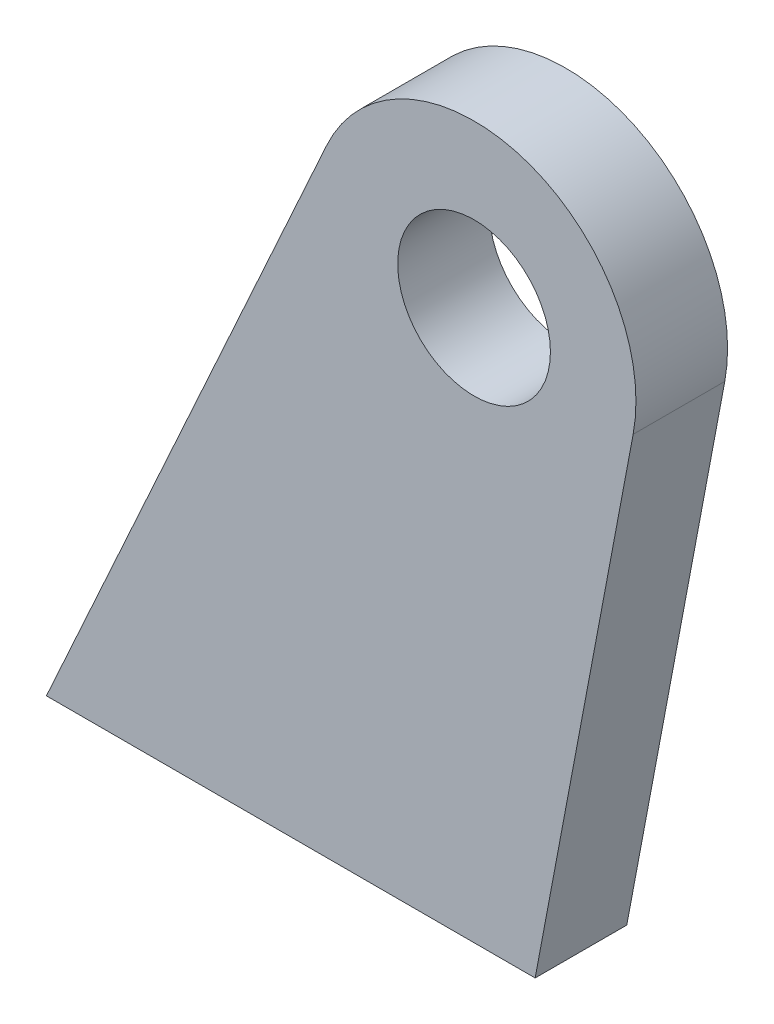
ISO-10303-21;
HEADER;
FILE_DESCRIPTION(('STEP AP214'),'2;1');
FILE_NAME('part.step','',(''),(''),'','','');
FILE_SCHEMA(('AUTOMOTIVE_DESIGN { 1 0 10303 214 1 1 1 1 }'));
ENDSEC;
DATA;
#1=APPLICATION_CONTEXT('core data for automotive mechanical design processes');
#2=APPLICATION_PROTOCOL_DEFINITION('international standard','automotive_design',2000,#1);
#3=PRODUCT_CONTEXT('',#1,'mechanical');
#4=PRODUCT('Part','Part','',(#3));
#5=PRODUCT_RELATED_PRODUCT_CATEGORY('part','',(#4));
#6=PRODUCT_DEFINITION_FORMATION('','',#4);
#7=PRODUCT_DEFINITION_CONTEXT('part definition',#1,'design');
#8=PRODUCT_DEFINITION('design','',#6,#7);
#9=PRODUCT_DEFINITION_SHAPE('','',#8);
#10=(LENGTH_UNIT() NAMED_UNIT(*) SI_UNIT(.MILLI.,.METRE.));
#11=(NAMED_UNIT(*) PLANE_ANGLE_UNIT() SI_UNIT($,.RADIAN.));
#12=(NAMED_UNIT(*) SI_UNIT($,.STERADIAN.) SOLID_ANGLE_UNIT());
#13=UNCERTAINTY_MEASURE_WITH_UNIT(LENGTH_MEASURE(1.E-05),#10,'distance_accuracy_value','');
#14=(GEOMETRIC_REPRESENTATION_CONTEXT(3) GLOBAL_UNCERTAINTY_ASSIGNED_CONTEXT((#13)) GLOBAL_UNIT_ASSIGNED_CONTEXT((#10,
#11,#12)) REPRESENTATION_CONTEXT('',''));
#15=CARTESIAN_POINT('',(0.,0.,0.));
#16=DIRECTION('',(0.,0.,1.));
#17=DIRECTION('',(1.,0.,0.));
#18=AXIS2_PLACEMENT_3D('',#15,#16,#17);
#19=CARTESIAN_POINT('',(33.0724377455002,-6.23481247272219,19.05));
#20=DIRECTION('',(0.982690172203245,-0.185256647532973,0.));
#21=DIRECTION('',(0.185256647532973,0.982690172203245,0.));
#22=AXIS2_PLACEMENT_3D('',#19,#20,#21);
#23=PLANE('',#22);
#24=DIRECTION('',(-0.185256647532973,-0.982690172203246,0.));
#25=VECTOR('',#24,1.);
#26=CARTESIAN_POINT('',(33.0724377455002,-6.23481247272219,0.));
#27=LINE('',#26,#25);
#28=CARTESIAN_POINT('',(33.0724377455002,-6.23481247272219,0.));
#29=VERTEX_POINT('',#28);
#30=CARTESIAN_POINT('',(12.7,-114.3,0.));
#31=VERTEX_POINT('',#30);
#32=EDGE_CURVE('E105',#29,#31,#27,.T.);
#33=ORIENTED_EDGE('',*,*,#32,.F.);
#34=DIRECTION('',(0.,0.,-1.));
#35=VECTOR('',#34,1.);
#36=CARTESIAN_POINT('',(33.0724377455002,-6.23481247272219,19.05));
#37=LINE('',#36,#35);
#38=CARTESIAN_POINT('',(33.0724377455002,-6.23481247272219,19.05));
#39=VERTEX_POINT('',#38);
#40=EDGE_CURVE('E11',#39,#29,#37,.T.);
#41=ORIENTED_EDGE('',*,*,#40,.F.);
#42=DIRECTION('',(-0.185256647532973,-0.982690172203246,0.));
#43=VECTOR('',#42,1.);
#44=CARTESIAN_POINT('',(33.0724377455002,-6.23481247272219,19.05));
#45=LINE('',#44,#43);
#46=CARTESIAN_POINT('',(12.7,-114.3,19.05));
#47=VERTEX_POINT('',#46);
#48=EDGE_CURVE('E91',#39,#47,#45,.T.);
#49=ORIENTED_EDGE('',*,*,#48,.T.);
#50=DIRECTION('',(0.,0.,-1.));
#51=VECTOR('',#50,1.);
#52=CARTESIAN_POINT('',(12.7,-114.3,19.05));
#53=LINE('',#52,#51);
#54=EDGE_CURVE('E73',#47,#31,#53,.T.);
#55=ORIENTED_EDGE('',*,*,#54,.T.);
#56=EDGE_LOOP('',(#33,#41,#49,#55));
#57=FACE_BOUND('',#56,.T.);
#58=ADVANCED_FACE('F34',(#57),#23,.T.);
#59=CARTESIAN_POINT('',(0.,0.,19.05));
#60=DIRECTION('',(0.,0.,-1.));
#61=DIRECTION('',(-1.,0.,0.));
#62=AXIS2_PLACEMENT_3D('',#59,#60,#61);
#63=CYLINDRICAL_SURFACE('',#62,33.655);
#64=CARTESIAN_POINT('',(0.,0.,0.));
#65=DIRECTION('',(0.,0.,1.));
#66=DIRECTION('',(1.,0.,0.));
#67=AXIS2_PLACEMENT_3D('',#64,#65,#66);
#68=CIRCLE('',#67,33.655);
#69=CARTESIAN_POINT('',(-30.6404695456118,13.9219485354758,0.));
#70=VERTEX_POINT('',#69);
#71=EDGE_CURVE('E96',#29,#70,#68,.T.);
#72=ORIENTED_EDGE('',*,*,#71,.T.);
#73=DIRECTION('',(0.,0.,-1.));
#74=VECTOR('',#73,1.);
#75=CARTESIAN_POINT('',(-30.6404695456118,13.9219485354758,19.05));
#76=LINE('',#75,#74);
#77=CARTESIAN_POINT('',(-30.6404695456118,13.9219485354758,19.05));
#78=VERTEX_POINT('',#77);
#79=EDGE_CURVE('E43',#78,#70,#76,.T.);
#80=ORIENTED_EDGE('',*,*,#79,.F.);
#81=CARTESIAN_POINT('',(0.,0.,19.05));
#82=DIRECTION('',(0.,0.,1.));
#83=DIRECTION('',(1.,0.,0.));
#84=AXIS2_PLACEMENT_3D('',#81,#82,#83);
#85=CIRCLE('',#84,33.655);
#86=EDGE_CURVE('E88',#39,#78,#85,.T.);
#87=ORIENTED_EDGE('',*,*,#86,.F.);
#88=ORIENTED_EDGE('',*,*,#40,.T.);
#89=EDGE_LOOP('',(#72,#80,#87,#88));
#90=FACE_BOUND('',#89,.T.);
#91=ADVANCED_FACE('F94',(#90),#63,.T.);
#92=CARTESIAN_POINT('',(-30.6404695456118,13.9219485354758,19.05));
#93=DIRECTION('',(0.910428451808402,-0.413666573628757,0.));
#94=DIRECTION('',(0.413666573628757,0.910428451808402,0.));
#95=AXIS2_PLACEMENT_3D('',#92,#93,#94);
#96=PLANE('',#95);
#97=DIRECTION('',(-0.413666573628757,-0.910428451808402,0.));
#98=VECTOR('',#97,1.);
#99=CARTESIAN_POINT('',(-30.6404695456118,13.9219485354758,0.));
#100=LINE('',#99,#98);
#101=CARTESIAN_POINT('',(-88.9,-114.3,0.));
#102=VERTEX_POINT('',#101);
#103=EDGE_CURVE('E102',#70,#102,#100,.T.);
#104=ORIENTED_EDGE('',*,*,#103,.T.);
#105=DIRECTION('',(0.,0.,-1.));
#106=VECTOR('',#105,1.);
#107=CARTESIAN_POINT('',(-88.9,-114.3,19.05));
#108=LINE('',#107,#106);
#109=CARTESIAN_POINT('',(-88.9,-114.3,19.05));
#110=VERTEX_POINT('',#109);
#111=EDGE_CURVE('E87',#110,#102,#108,.T.);
#112=ORIENTED_EDGE('',*,*,#111,.F.);
#113=DIRECTION('',(-0.413666573628757,-0.910428451808402,0.));
#114=VECTOR('',#113,1.);
#115=CARTESIAN_POINT('',(-30.6404695456118,13.9219485354758,19.05));
#116=LINE('',#115,#114);
#117=EDGE_CURVE('E81',#78,#110,#116,.T.);
#118=ORIENTED_EDGE('',*,*,#117,.F.);
#119=ORIENTED_EDGE('',*,*,#79,.T.);
#120=EDGE_LOOP('',(#104,#112,#118,#119));
#121=FACE_BOUND('',#120,.T.);
#122=ADVANCED_FACE('F84',(#121),#96,.F.);
#123=CARTESIAN_POINT('',(0.,0.,19.05));
#124=DIRECTION('',(0.,0.,-1.));
#125=DIRECTION('',(-1.,0.,0.));
#126=AXIS2_PLACEMENT_3D('',#123,#124,#125);
#127=CYLINDRICAL_SURFACE('',#126,15.875);
#128=CARTESIAN_POINT('',(0.,0.,19.05));
#129=DIRECTION('',(0.,0.,1.));
#130=DIRECTION('',(1.,0.,0.));
#131=AXIS2_PLACEMENT_3D('',#128,#129,#130);
#132=CIRCLE('',#131,15.875);
#133=CARTESIAN_POINT('',(15.875,0.,19.05));
#134=VERTEX_POINT('',#133);
#135=EDGE_CURVE('E101',#134,#134,#132,.T.);
#136=ORIENTED_EDGE('',*,*,#135,.T.);
#137=EDGE_LOOP('',(#136));
#138=FACE_BOUND('',#137,.T.);
#139=CARTESIAN_POINT('',(0.,0.,0.));
#140=DIRECTION('',(0.,0.,1.));
#141=DIRECTION('',(1.,0.,0.));
#142=AXIS2_PLACEMENT_3D('',#139,#140,#141);
#143=CIRCLE('',#142,15.875);
#144=CARTESIAN_POINT('',(15.875,0.,0.));
#145=VERTEX_POINT('',#144);
#146=EDGE_CURVE('E107',#145,#145,#143,.T.);
#147=ORIENTED_EDGE('',*,*,#146,.F.);
#148=EDGE_LOOP('',(#147));
#149=FACE_BOUND('',#148,.T.);
#150=ADVANCED_FACE('F36',(#138,#149),#127,.F.);
#151=CARTESIAN_POINT('',(0.,-114.3,19.05));
#152=DIRECTION('',(0.,1.,0.));
#153=DIRECTION('',(-1.,0.,0.));
#154=AXIS2_PLACEMENT_3D('',#151,#152,#153);
#155=PLANE('',#154);
#156=DIRECTION('',(1.,0.,0.));
#157=VECTOR('',#156,1.);
#158=CARTESIAN_POINT('',(0.,-114.3,0.));
#159=LINE('',#158,#157);
#160=EDGE_CURVE('E66',#102,#31,#159,.T.);
#161=ORIENTED_EDGE('',*,*,#160,.T.);
#162=ORIENTED_EDGE('',*,*,#54,.F.);
#163=DIRECTION('',(1.,0.,0.));
#164=VECTOR('',#163,1.);
#165=CARTESIAN_POINT('',(0.,-114.3,19.05));
#166=LINE('',#165,#164);
#167=EDGE_CURVE('E51',#110,#47,#166,.T.);
#168=ORIENTED_EDGE('',*,*,#167,.F.);
#169=ORIENTED_EDGE('',*,*,#111,.T.);
#170=EDGE_LOOP('',(#161,#162,#168,#169));
#171=FACE_BOUND('',#170,.T.);
#172=ADVANCED_FACE('F119',(#171),#155,.F.);
#173=CARTESIAN_POINT('',(0.,0.,19.05));
#174=DIRECTION('',(0.,0.,1.));
#175=DIRECTION('',(1.,0.,0.));
#176=AXIS2_PLACEMENT_3D('',#173,#174,#175);
#177=PLANE('',#176);
#178=ORIENTED_EDGE('',*,*,#135,.F.);
#179=EDGE_LOOP('',(#178));
#180=FACE_BOUND('',#179,.T.);
#181=ORIENTED_EDGE('',*,*,#48,.F.);
#182=ORIENTED_EDGE('',*,*,#86,.T.);
#183=ORIENTED_EDGE('',*,*,#117,.T.);
#184=ORIENTED_EDGE('',*,*,#167,.T.);
#185=EDGE_LOOP('',(#181,#182,#183,#184));
#186=FACE_BOUND('',#185,.T.);
#187=ADVANCED_FACE('F90',(#180,#186),#177,.T.);
#188=CARTESIAN_POINT('',(0.,0.,0.));
#189=DIRECTION('',(0.,0.,1.));
#190=DIRECTION('',(1.,0.,0.));
#191=AXIS2_PLACEMENT_3D('',#188,#189,#190);
#192=PLANE('',#191);
#193=ORIENTED_EDGE('',*,*,#146,.T.);
#194=EDGE_LOOP('',(#193));
#195=FACE_BOUND('',#194,.T.);
#196=ORIENTED_EDGE('',*,*,#32,.T.);
#197=ORIENTED_EDGE('',*,*,#160,.F.);
#198=ORIENTED_EDGE('',*,*,#103,.F.);
#199=ORIENTED_EDGE('',*,*,#71,.F.);
#200=EDGE_LOOP('',(#196,#197,#198,#199));
#201=FACE_BOUND('',#200,.T.);
#202=ADVANCED_FACE('F118',(#195,#201),#192,.F.);
#203=CLOSED_SHELL('',(#58,#91,#122,#150,#172,#187,#202));
#204=MANIFOLD_SOLID_BREP('B2',#203);
#205=ADVANCED_BREP_SHAPE_REPRESENTATION('',(#18,#204),#14);
#206=SHAPE_DEFINITION_REPRESENTATION(#9,#205);
ENDSEC;
END-ISO-10303-21;
